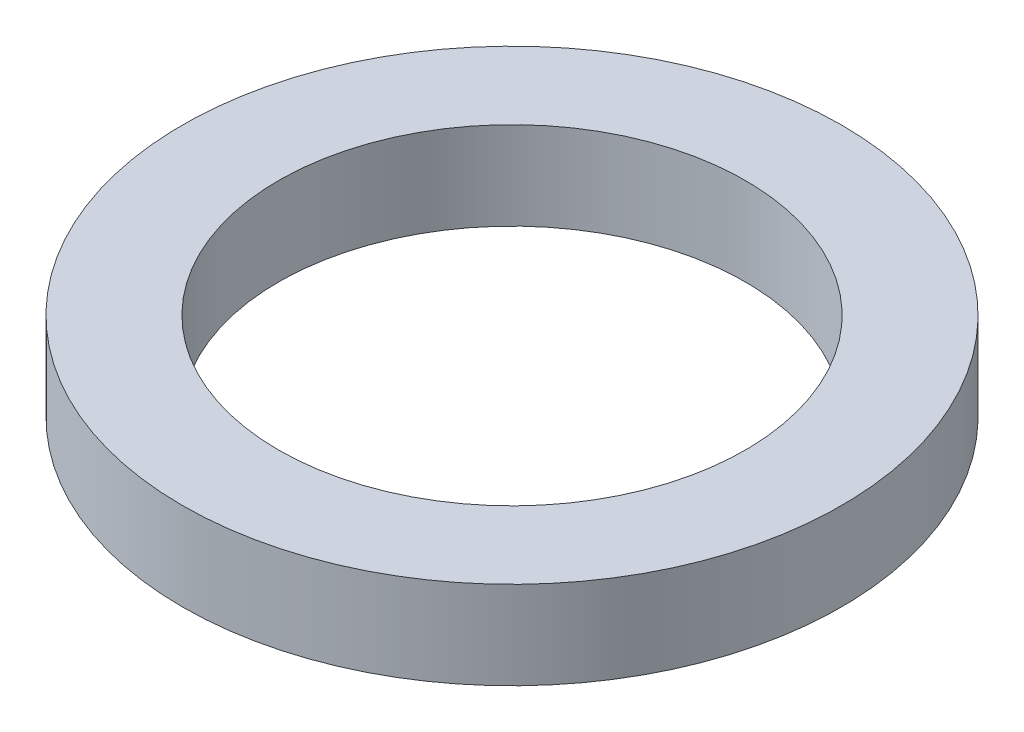
ISO-10303-21;
HEADER;
FILE_DESCRIPTION(('STEP AP214'),'2;1');
FILE_NAME('part.step','',(''),(''),'','','');
FILE_SCHEMA(('AUTOMOTIVE_DESIGN { 1 0 10303 214 1 1 1 1 }'));
ENDSEC;
DATA;
#1=APPLICATION_CONTEXT('core data for automotive mechanical design processes');
#2=APPLICATION_PROTOCOL_DEFINITION('international standard','automotive_design',2000,#1);
#3=PRODUCT_CONTEXT('',#1,'mechanical');
#4=PRODUCT('Part','Part','',(#3));
#5=PRODUCT_RELATED_PRODUCT_CATEGORY('part','',(#4));
#6=PRODUCT_DEFINITION_FORMATION('','',#4);
#7=PRODUCT_DEFINITION_CONTEXT('part definition',#1,'design');
#8=PRODUCT_DEFINITION('design','',#6,#7);
#9=PRODUCT_DEFINITION_SHAPE('','',#8);
#10=(LENGTH_UNIT() NAMED_UNIT(*) SI_UNIT(.MILLI.,.METRE.));
#11=(NAMED_UNIT(*) PLANE_ANGLE_UNIT() SI_UNIT($,.RADIAN.));
#12=(NAMED_UNIT(*) SI_UNIT($,.STERADIAN.) SOLID_ANGLE_UNIT());
#13=UNCERTAINTY_MEASURE_WITH_UNIT(LENGTH_MEASURE(1.E-05),#10,'distance_accuracy_value','');
#14=(GEOMETRIC_REPRESENTATION_CONTEXT(3) GLOBAL_UNCERTAINTY_ASSIGNED_CONTEXT((#13)) GLOBAL_UNIT_ASSIGNED_CONTEXT((#10,
#11,#12)) REPRESENTATION_CONTEXT('',''));
#15=CARTESIAN_POINT('',(0.,0.,0.));
#16=DIRECTION('',(0.,0.,1.));
#17=DIRECTION('',(1.,0.,0.));
#18=AXIS2_PLACEMENT_3D('',#15,#16,#17);
#19=CARTESIAN_POINT('',(0.,16.,0.));
#20=DIRECTION('',(0.,-1.,0.));
#21=DIRECTION('',(0.,0.,-1.));
#22=AXIS2_PLACEMENT_3D('',#19,#20,#21);
#23=CYLINDRICAL_SURFACE('',#22,60.);
#24=CARTESIAN_POINT('',(0.,16.,0.));
#25=DIRECTION('',(0.,1.,0.));
#26=DIRECTION('',(0.,0.,1.));
#27=AXIS2_PLACEMENT_3D('',#24,#25,#26);
#28=CIRCLE('',#27,60.);
#29=CARTESIAN_POINT('',(0.,16.,60.));
#30=VERTEX_POINT('',#29);
#31=EDGE_CURVE('E10',#30,#30,#28,.T.);
#32=ORIENTED_EDGE('',*,*,#31,.F.);
#33=EDGE_LOOP('',(#32));
#34=FACE_BOUND('',#33,.T.);
#35=CARTESIAN_POINT('',(0.,0.,0.));
#36=DIRECTION('',(0.,1.,0.));
#37=DIRECTION('',(0.,0.,1.));
#38=AXIS2_PLACEMENT_3D('',#35,#36,#37);
#39=CIRCLE('',#38,60.);
#40=CARTESIAN_POINT('',(0.,0.,60.));
#41=VERTEX_POINT('',#40);
#42=EDGE_CURVE('E37',#41,#41,#39,.T.);
#43=ORIENTED_EDGE('',*,*,#42,.T.);
#44=EDGE_LOOP('',(#43));
#45=FACE_BOUND('',#44,.T.);
#46=ADVANCED_FACE('F40',(#34,#45),#23,.T.);
#47=CARTESIAN_POINT('',(0.,16.,0.));
#48=DIRECTION('',(0.,1.,0.));
#49=DIRECTION('',(0.,0.,1.));
#50=AXIS2_PLACEMENT_3D('',#47,#48,#49);
#51=PLANE('',#50);
#52=CARTESIAN_POINT('',(0.,16.,0.));
#53=DIRECTION('',(0.,1.,0.));
#54=DIRECTION('',(0.,0.,1.));
#55=AXIS2_PLACEMENT_3D('',#52,#53,#54);
#56=CIRCLE('',#55,42.5);
#57=CARTESIAN_POINT('',(0.,16.,42.5));
#58=VERTEX_POINT('',#57);
#59=EDGE_CURVE('E50',#58,#58,#56,.T.);
#60=ORIENTED_EDGE('',*,*,#59,.F.);
#61=EDGE_LOOP('',(#60));
#62=FACE_BOUND('',#61,.T.);
#63=ORIENTED_EDGE('',*,*,#31,.T.);
#64=EDGE_LOOP('',(#63));
#65=FACE_BOUND('',#64,.T.);
#66=ADVANCED_FACE('F59',(#62,#65),#51,.T.);
#67=CARTESIAN_POINT('',(0.,0.,0.));
#68=DIRECTION('',(0.,1.,0.));
#69=DIRECTION('',(0.,0.,1.));
#70=AXIS2_PLACEMENT_3D('',#67,#68,#69);
#71=PLANE('',#70);
#72=CARTESIAN_POINT('',(0.,0.,0.));
#73=DIRECTION('',(0.,1.,0.));
#74=DIRECTION('',(0.,0.,1.));
#75=AXIS2_PLACEMENT_3D('',#72,#73,#74);
#76=CIRCLE('',#75,42.5);
#77=CARTESIAN_POINT('',(0.,0.,42.5));
#78=VERTEX_POINT('',#77);
#79=EDGE_CURVE('E47',#78,#78,#76,.T.);
#80=ORIENTED_EDGE('',*,*,#79,.T.);
#81=EDGE_LOOP('',(#80));
#82=FACE_BOUND('',#81,.T.);
#83=ORIENTED_EDGE('',*,*,#42,.F.);
#84=EDGE_LOOP('',(#83));
#85=FACE_BOUND('',#84,.T.);
#86=ADVANCED_FACE('F58',(#82,#85),#71,.F.);
#87=CARTESIAN_POINT('',(0.,16.,0.));
#88=DIRECTION('',(0.,-1.,0.));
#89=DIRECTION('',(0.,0.,-1.));
#90=AXIS2_PLACEMENT_3D('',#87,#88,#89);
#91=CYLINDRICAL_SURFACE('',#90,42.5);
#92=ORIENTED_EDGE('',*,*,#59,.T.);
#93=EDGE_LOOP('',(#92));
#94=FACE_BOUND('',#93,.T.);
#95=ORIENTED_EDGE('',*,*,#79,.F.);
#96=EDGE_LOOP('',(#95));
#97=FACE_BOUND('',#96,.T.);
#98=ADVANCED_FACE('F54',(#94,#97),#91,.F.);
#99=CLOSED_SHELL('',(#46,#66,#86,#98));
#100=MANIFOLD_SOLID_BREP('B2',#99);
#101=ADVANCED_BREP_SHAPE_REPRESENTATION('',(#18,#100),#14);
#102=SHAPE_DEFINITION_REPRESENTATION(#9,#101);
ENDSEC;
END-ISO-10303-21;
